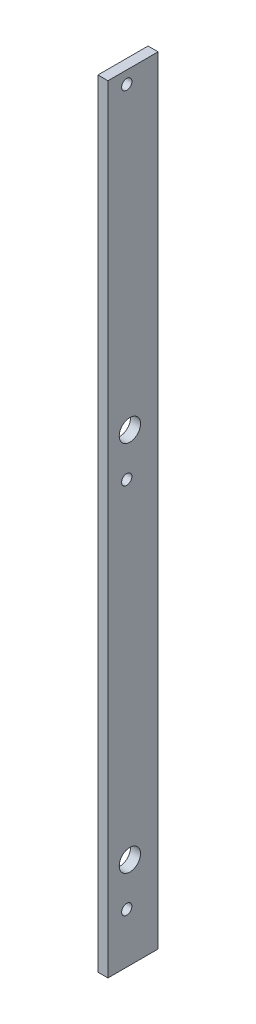
ISO-10303-21;
HEADER;
FILE_DESCRIPTION(('STEP AP214'),'2;1');
FILE_NAME('part.step','',(''),(''),'','','');
FILE_SCHEMA(('AUTOMOTIVE_DESIGN { 1 0 10303 214 1 1 1 1 }'));
ENDSEC;
DATA;
#1=APPLICATION_CONTEXT('core data for automotive mechanical design processes');
#2=APPLICATION_PROTOCOL_DEFINITION('international standard','automotive_design',2000,#1);
#3=PRODUCT_CONTEXT('',#1,'mechanical');
#4=PRODUCT('Part','Part','',(#3));
#5=PRODUCT_RELATED_PRODUCT_CATEGORY('part','',(#4));
#6=PRODUCT_DEFINITION_FORMATION('','',#4);
#7=PRODUCT_DEFINITION_CONTEXT('part definition',#1,'design');
#8=PRODUCT_DEFINITION('design','',#6,#7);
#9=PRODUCT_DEFINITION_SHAPE('','',#8);
#10=(LENGTH_UNIT() NAMED_UNIT(*) SI_UNIT(.MILLI.,.METRE.));
#11=(NAMED_UNIT(*) PLANE_ANGLE_UNIT() SI_UNIT($,.RADIAN.));
#12=(NAMED_UNIT(*) SI_UNIT($,.STERADIAN.) SOLID_ANGLE_UNIT());
#13=UNCERTAINTY_MEASURE_WITH_UNIT(LENGTH_MEASURE(1.E-05),#10,'distance_accuracy_value','');
#14=(GEOMETRIC_REPRESENTATION_CONTEXT(3) GLOBAL_UNCERTAINTY_ASSIGNED_CONTEXT((#13)) GLOBAL_UNIT_ASSIGNED_CONTEXT((#10,
#11,#12)) REPRESENTATION_CONTEXT('',''));
#15=CARTESIAN_POINT('',(0.,0.,0.));
#16=DIRECTION('',(0.,0.,1.));
#17=DIRECTION('',(1.,0.,0.));
#18=AXIS2_PLACEMENT_3D('',#15,#16,#17);
#19=CARTESIAN_POINT('',(-8.,310.,20.));
#20=DIRECTION('',(0.,0.,1.));
#21=DIRECTION('',(0.,-1.,0.));
#22=AXIS2_PLACEMENT_3D('',#19,#20,#21);
#23=PLANE('',#22);
#24=DIRECTION('',(0.,-1.,0.));
#25=VECTOR('',#24,1.);
#26=CARTESIAN_POINT('',(0.,310.,20.));
#27=LINE('',#26,#25);
#28=CARTESIAN_POINT('',(0.,310.,20.));
#29=VERTEX_POINT('',#28);
#30=CARTESIAN_POINT('',(0.,-310.,20.));
#31=VERTEX_POINT('',#30);
#32=EDGE_CURVE('E101',#29,#31,#27,.T.);
#33=ORIENTED_EDGE('',*,*,#32,.F.);
#34=DIRECTION('',(1.,0.,0.));
#35=VECTOR('',#34,1.);
#36=CARTESIAN_POINT('',(-8.,310.,20.));
#37=LINE('',#36,#35);
#38=CARTESIAN_POINT('',(-8.,310.,20.));
#39=VERTEX_POINT('',#38);
#40=EDGE_CURVE('E11',#39,#29,#37,.T.);
#41=ORIENTED_EDGE('',*,*,#40,.F.);
#42=DIRECTION('',(0.,-1.,0.));
#43=VECTOR('',#42,1.);
#44=CARTESIAN_POINT('',(-8.,310.,20.));
#45=LINE('',#44,#43);
#46=CARTESIAN_POINT('',(-8.,-310.,20.));
#47=VERTEX_POINT('',#46);
#48=EDGE_CURVE('E94',#39,#47,#45,.T.);
#49=ORIENTED_EDGE('',*,*,#48,.T.);
#50=DIRECTION('',(1.,0.,0.));
#51=VECTOR('',#50,1.);
#52=CARTESIAN_POINT('',(-8.,-310.,20.));
#53=LINE('',#52,#51);
#54=EDGE_CURVE('E39',#47,#31,#53,.T.);
#55=ORIENTED_EDGE('',*,*,#54,.T.);
#56=EDGE_LOOP('',(#33,#41,#49,#55));
#57=FACE_BOUND('',#56,.T.);
#58=ADVANCED_FACE('F36',(#57),#23,.T.);
#59=CARTESIAN_POINT('',(-8.,310.,-20.));
#60=DIRECTION('',(0.,1.,0.));
#61=DIRECTION('',(0.,0.,1.));
#62=AXIS2_PLACEMENT_3D('',#59,#60,#61);
#63=PLANE('',#62);
#64=DIRECTION('',(0.,0.,1.));
#65=VECTOR('',#64,1.);
#66=CARTESIAN_POINT('',(0.,310.,-20.));
#67=LINE('',#66,#65);
#68=CARTESIAN_POINT('',(0.,310.,-20.));
#69=VERTEX_POINT('',#68);
#70=EDGE_CURVE('E96',#69,#29,#67,.T.);
#71=ORIENTED_EDGE('',*,*,#70,.F.);
#72=DIRECTION('',(1.,0.,0.));
#73=VECTOR('',#72,1.);
#74=CARTESIAN_POINT('',(-8.,310.,-20.));
#75=LINE('',#74,#73);
#76=CARTESIAN_POINT('',(-8.,310.,-20.));
#77=VERTEX_POINT('',#76);
#78=EDGE_CURVE('E45',#77,#69,#75,.T.);
#79=ORIENTED_EDGE('',*,*,#78,.F.);
#80=DIRECTION('',(0.,0.,1.));
#81=VECTOR('',#80,1.);
#82=CARTESIAN_POINT('',(-8.,310.,-20.));
#83=LINE('',#82,#81);
#84=EDGE_CURVE('E91',#77,#39,#83,.T.);
#85=ORIENTED_EDGE('',*,*,#84,.T.);
#86=ORIENTED_EDGE('',*,*,#40,.T.);
#87=EDGE_LOOP('',(#71,#79,#85,#86));
#88=FACE_BOUND('',#87,.T.);
#89=ADVANCED_FACE('F112',(#88),#63,.T.);
#90=CARTESIAN_POINT('',(-8.,310.,-20.));
#91=DIRECTION('',(0.,0.,-1.));
#92=DIRECTION('',(0.,1.,0.));
#93=AXIS2_PLACEMENT_3D('',#90,#91,#92);
#94=PLANE('',#93);
#95=DIRECTION('',(0.,1.,0.));
#96=VECTOR('',#95,1.);
#97=CARTESIAN_POINT('',(0.,310.,-20.));
#98=LINE('',#97,#96);
#99=CARTESIAN_POINT('',(0.,-310.,-20.));
#100=VERTEX_POINT('',#99);
#101=EDGE_CURVE('E86',#100,#69,#98,.T.);
#102=ORIENTED_EDGE('',*,*,#101,.F.);
#103=DIRECTION('',(1.,0.,0.));
#104=VECTOR('',#103,1.);
#105=CARTESIAN_POINT('',(-8.,-310.,-20.));
#106=LINE('',#105,#104);
#107=CARTESIAN_POINT('',(-8.,-310.,-20.));
#108=VERTEX_POINT('',#107);
#109=EDGE_CURVE('E81',#108,#100,#106,.T.);
#110=ORIENTED_EDGE('',*,*,#109,.F.);
#111=DIRECTION('',(0.,1.,0.));
#112=VECTOR('',#111,1.);
#113=CARTESIAN_POINT('',(-8.,310.,-20.));
#114=LINE('',#113,#112);
#115=EDGE_CURVE('E84',#108,#77,#114,.T.);
#116=ORIENTED_EDGE('',*,*,#115,.T.);
#117=ORIENTED_EDGE('',*,*,#78,.T.);
#118=EDGE_LOOP('',(#102,#110,#116,#117));
#119=FACE_BOUND('',#118,.T.);
#120=ADVANCED_FACE('F83',(#119),#94,.T.);
#121=CARTESIAN_POINT('',(-8.,-310.,-20.));
#122=DIRECTION('',(0.,-1.,0.));
#123=DIRECTION('',(0.,0.,-1.));
#124=AXIS2_PLACEMENT_3D('',#121,#122,#123);
#125=PLANE('',#124);
#126=DIRECTION('',(0.,0.,-1.));
#127=VECTOR('',#126,1.);
#128=CARTESIAN_POINT('',(0.,-310.,-20.));
#129=LINE('',#128,#127);
#130=EDGE_CURVE('E104',#31,#100,#129,.T.);
#131=ORIENTED_EDGE('',*,*,#130,.F.);
#132=ORIENTED_EDGE('',*,*,#54,.F.);
#133=DIRECTION('',(0.,0.,-1.));
#134=VECTOR('',#133,1.);
#135=CARTESIAN_POINT('',(-8.,-310.,-20.));
#136=LINE('',#135,#134);
#137=EDGE_CURVE('E90',#47,#108,#136,.T.);
#138=ORIENTED_EDGE('',*,*,#137,.T.);
#139=ORIENTED_EDGE('',*,*,#109,.T.);
#140=EDGE_LOOP('',(#131,#132,#138,#139));
#141=FACE_BOUND('',#140,.T.);
#142=ADVANCED_FACE('F93',(#141),#125,.T.);
#143=CARTESIAN_POINT('',(-8.,0.,0.));
#144=DIRECTION('',(-1.,0.,0.));
#145=DIRECTION('',(0.,0.,1.));
#146=AXIS2_PLACEMENT_3D('',#143,#144,#145);
#147=PLANE('',#146);
#148=CARTESIAN_POINT('',(-8.,300.,5.00000000000004));
#149=DIRECTION('',(-1.,0.,0.));
#150=DIRECTION('',(0.,0.,1.));
#151=AXIS2_PLACEMENT_3D('',#148,#149,#150);
#152=CIRCLE('',#151,4.09999999999999);
#153=CARTESIAN_POINT('',(-8.,300.,9.10000000000002));
#154=VERTEX_POINT('',#153);
#155=EDGE_CURVE('E159',#154,#154,#152,.T.);
#156=ORIENTED_EDGE('',*,*,#155,.F.);
#157=EDGE_LOOP('',(#156));
#158=FACE_BOUND('',#157,.T.);
#159=CARTESIAN_POINT('',(-8.,27.,5.00000000000004));
#160=DIRECTION('',(-1.,0.,0.));
#161=DIRECTION('',(0.,0.,1.));
#162=AXIS2_PLACEMENT_3D('',#159,#160,#161);
#163=CIRCLE('',#162,4.1);
#164=CARTESIAN_POINT('',(-8.,27.,9.10000000000004));
#165=VERTEX_POINT('',#164);
#166=EDGE_CURVE('E177',#165,#165,#163,.T.);
#167=ORIENTED_EDGE('',*,*,#166,.F.);
#168=EDGE_LOOP('',(#167));
#169=FACE_BOUND('',#168,.T.);
#170=CARTESIAN_POINT('',(-8.,-237.,2.50000000000003));
#171=DIRECTION('',(-1.,0.,0.));
#172=DIRECTION('',(0.,0.,1.));
#173=AXIS2_PLACEMENT_3D('',#170,#171,#172);
#174=CIRCLE('',#173,8.5);
#175=CARTESIAN_POINT('',(-8.,-237.,11.));
#176=VERTEX_POINT('',#175);
#177=EDGE_CURVE('E171',#176,#176,#174,.T.);
#178=ORIENTED_EDGE('',*,*,#177,.F.);
#179=EDGE_LOOP('',(#178));
#180=FACE_BOUND('',#179,.T.);
#181=CARTESIAN_POINT('',(-8.,60.,2.50000000000003));
#182=DIRECTION('',(-1.,0.,0.));
#183=DIRECTION('',(0.,0.,1.));
#184=AXIS2_PLACEMENT_3D('',#181,#182,#183);
#185=CIRCLE('',#184,8.5);
#186=CARTESIAN_POINT('',(-8.,60.,11.));
#187=VERTEX_POINT('',#186);
#188=EDGE_CURVE('E170',#187,#187,#185,.T.);
#189=ORIENTED_EDGE('',*,*,#188,.F.);
#190=EDGE_LOOP('',(#189));
#191=FACE_BOUND('',#190,.T.);
#192=CARTESIAN_POINT('',(-8.,-270.,5.00000000000004));
#193=DIRECTION('',(-1.,0.,0.));
#194=DIRECTION('',(0.,0.,1.));
#195=AXIS2_PLACEMENT_3D('',#192,#193,#194);
#196=CIRCLE('',#195,4.09999999999999);
#197=CARTESIAN_POINT('',(-8.,-270.,9.10000000000002));
#198=VERTEX_POINT('',#197);
#199=EDGE_CURVE('E164',#198,#198,#196,.T.);
#200=ORIENTED_EDGE('',*,*,#199,.F.);
#201=EDGE_LOOP('',(#200));
#202=FACE_BOUND('',#201,.T.);
#203=ORIENTED_EDGE('',*,*,#48,.F.);
#204=ORIENTED_EDGE('',*,*,#84,.F.);
#205=ORIENTED_EDGE('',*,*,#115,.F.);
#206=ORIENTED_EDGE('',*,*,#137,.F.);
#207=EDGE_LOOP('',(#203,#204,#205,#206));
#208=FACE_BOUND('',#207,.T.);
#209=ADVANCED_FACE('F89',(#158,#169,#180,#191,#202,#208),#147,.T.);
#210=CARTESIAN_POINT('',(0.,0.,0.));
#211=DIRECTION('',(-1.,0.,0.));
#212=DIRECTION('',(0.,0.,1.));
#213=AXIS2_PLACEMENT_3D('',#210,#211,#212);
#214=PLANE('',#213);
#215=CARTESIAN_POINT('',(0.,300.,5.00000000000004));
#216=DIRECTION('',(-1.,0.,0.));
#217=DIRECTION('',(0.,0.,1.));
#218=AXIS2_PLACEMENT_3D('',#215,#216,#217);
#219=CIRCLE('',#218,4.09999999999999);
#220=CARTESIAN_POINT('',(0.,300.,9.10000000000002));
#221=VERTEX_POINT('',#220);
#222=EDGE_CURVE('E105',#221,#221,#219,.T.);
#223=ORIENTED_EDGE('',*,*,#222,.T.);
#224=EDGE_LOOP('',(#223));
#225=FACE_BOUND('',#224,.T.);
#226=CARTESIAN_POINT('',(0.,27.,5.00000000000004));
#227=DIRECTION('',(-1.,0.,0.));
#228=DIRECTION('',(0.,0.,1.));
#229=AXIS2_PLACEMENT_3D('',#226,#227,#228);
#230=CIRCLE('',#229,4.1);
#231=CARTESIAN_POINT('',(0.,27.,9.10000000000004));
#232=VERTEX_POINT('',#231);
#233=EDGE_CURVE('E174',#232,#232,#230,.T.);
#234=ORIENTED_EDGE('',*,*,#233,.T.);
#235=EDGE_LOOP('',(#234));
#236=FACE_BOUND('',#235,.T.);
#237=CARTESIAN_POINT('',(0.,-237.,2.50000000000003));
#238=DIRECTION('',(-1.,0.,0.));
#239=DIRECTION('',(0.,0.,1.));
#240=AXIS2_PLACEMENT_3D('',#237,#238,#239);
#241=CIRCLE('',#240,8.5);
#242=CARTESIAN_POINT('',(0.,-237.,11.));
#243=VERTEX_POINT('',#242);
#244=EDGE_CURVE('E167',#243,#243,#241,.T.);
#245=ORIENTED_EDGE('',*,*,#244,.T.);
#246=EDGE_LOOP('',(#245));
#247=FACE_BOUND('',#246,.T.);
#248=CARTESIAN_POINT('',(0.,60.,2.50000000000003));
#249=DIRECTION('',(-1.,0.,0.));
#250=DIRECTION('',(0.,0.,1.));
#251=AXIS2_PLACEMENT_3D('',#248,#249,#250);
#252=CIRCLE('',#251,8.5);
#253=CARTESIAN_POINT('',(0.,60.,11.));
#254=VERTEX_POINT('',#253);
#255=EDGE_CURVE('E182',#254,#254,#252,.T.);
#256=ORIENTED_EDGE('',*,*,#255,.T.);
#257=EDGE_LOOP('',(#256));
#258=FACE_BOUND('',#257,.T.);
#259=CARTESIAN_POINT('',(0.,-270.,5.00000000000004));
#260=DIRECTION('',(-1.,0.,0.));
#261=DIRECTION('',(0.,0.,1.));
#262=AXIS2_PLACEMENT_3D('',#259,#260,#261);
#263=CIRCLE('',#262,4.09999999999999);
#264=CARTESIAN_POINT('',(0.,-270.,9.10000000000002));
#265=VERTEX_POINT('',#264);
#266=EDGE_CURVE('E160',#265,#265,#263,.T.);
#267=ORIENTED_EDGE('',*,*,#266,.T.);
#268=EDGE_LOOP('',(#267));
#269=FACE_BOUND('',#268,.T.);
#270=ORIENTED_EDGE('',*,*,#32,.T.);
#271=ORIENTED_EDGE('',*,*,#130,.T.);
#272=ORIENTED_EDGE('',*,*,#101,.T.);
#273=ORIENTED_EDGE('',*,*,#70,.T.);
#274=EDGE_LOOP('',(#270,#271,#272,#273));
#275=FACE_BOUND('',#274,.T.);
#276=ADVANCED_FACE('F111',(#225,#236,#247,#258,#269,#275),#214,.F.);
#277=CARTESIAN_POINT('',(0.,-270.,5.00000000000004));
#278=DIRECTION('',(-1.,0.,0.));
#279=DIRECTION('',(0.,0.,1.));
#280=AXIS2_PLACEMENT_3D('',#277,#278,#279);
#281=CYLINDRICAL_SURFACE('',#280,4.09999999999999);
#282=ORIENTED_EDGE('',*,*,#266,.F.);
#283=EDGE_LOOP('',(#282));
#284=FACE_BOUND('',#283,.T.);
#285=ORIENTED_EDGE('',*,*,#199,.T.);
#286=EDGE_LOOP('',(#285));
#287=FACE_BOUND('',#286,.T.);
#288=ADVANCED_FACE('F130',(#284,#287),#281,.F.);
#289=CARTESIAN_POINT('',(0.,60.,2.50000000000003));
#290=DIRECTION('',(-1.,0.,0.));
#291=DIRECTION('',(0.,0.,1.));
#292=AXIS2_PLACEMENT_3D('',#289,#290,#291);
#293=CYLINDRICAL_SURFACE('',#292,8.5);
#294=ORIENTED_EDGE('',*,*,#255,.F.);
#295=EDGE_LOOP('',(#294));
#296=FACE_BOUND('',#295,.T.);
#297=ORIENTED_EDGE('',*,*,#188,.T.);
#298=EDGE_LOOP('',(#297));
#299=FACE_BOUND('',#298,.T.);
#300=ADVANCED_FACE('F135',(#296,#299),#293,.F.);
#301=CARTESIAN_POINT('',(0.,-237.,2.50000000000003));
#302=DIRECTION('',(-1.,0.,0.));
#303=DIRECTION('',(0.,0.,1.));
#304=AXIS2_PLACEMENT_3D('',#301,#302,#303);
#305=CYLINDRICAL_SURFACE('',#304,8.5);
#306=ORIENTED_EDGE('',*,*,#244,.F.);
#307=EDGE_LOOP('',(#306));
#308=FACE_BOUND('',#307,.T.);
#309=ORIENTED_EDGE('',*,*,#177,.T.);
#310=EDGE_LOOP('',(#309));
#311=FACE_BOUND('',#310,.T.);
#312=ADVANCED_FACE('F138',(#308,#311),#305,.F.);
#313=CARTESIAN_POINT('',(0.,27.,5.00000000000004));
#314=DIRECTION('',(-1.,0.,0.));
#315=DIRECTION('',(0.,0.,1.));
#316=AXIS2_PLACEMENT_3D('',#313,#314,#315);
#317=CYLINDRICAL_SURFACE('',#316,4.1);
#318=ORIENTED_EDGE('',*,*,#233,.F.);
#319=EDGE_LOOP('',(#318));
#320=FACE_BOUND('',#319,.T.);
#321=ORIENTED_EDGE('',*,*,#166,.T.);
#322=EDGE_LOOP('',(#321));
#323=FACE_BOUND('',#322,.T.);
#324=ADVANCED_FACE('F143',(#320,#323),#317,.F.);
#325=CARTESIAN_POINT('',(0.,300.,5.00000000000004));
#326=DIRECTION('',(-1.,0.,0.));
#327=DIRECTION('',(0.,0.,1.));
#328=AXIS2_PLACEMENT_3D('',#325,#326,#327);
#329=CYLINDRICAL_SURFACE('',#328,4.09999999999999);
#330=ORIENTED_EDGE('',*,*,#222,.F.);
#331=EDGE_LOOP('',(#330));
#332=FACE_BOUND('',#331,.T.);
#333=ORIENTED_EDGE('',*,*,#155,.T.);
#334=EDGE_LOOP('',(#333));
#335=FACE_BOUND('',#334,.T.);
#336=ADVANCED_FACE('F146',(#332,#335),#329,.F.);
#337=CLOSED_SHELL('',(#58,#89,#120,#142,#209,#276,#288,#300,#312,#324,#336));
#338=MANIFOLD_SOLID_BREP('B2',#337);
#339=ADVANCED_BREP_SHAPE_REPRESENTATION('',(#18,#338),#14);
#340=SHAPE_DEFINITION_REPRESENTATION(#9,#339);
ENDSEC;
END-ISO-10303-21;
